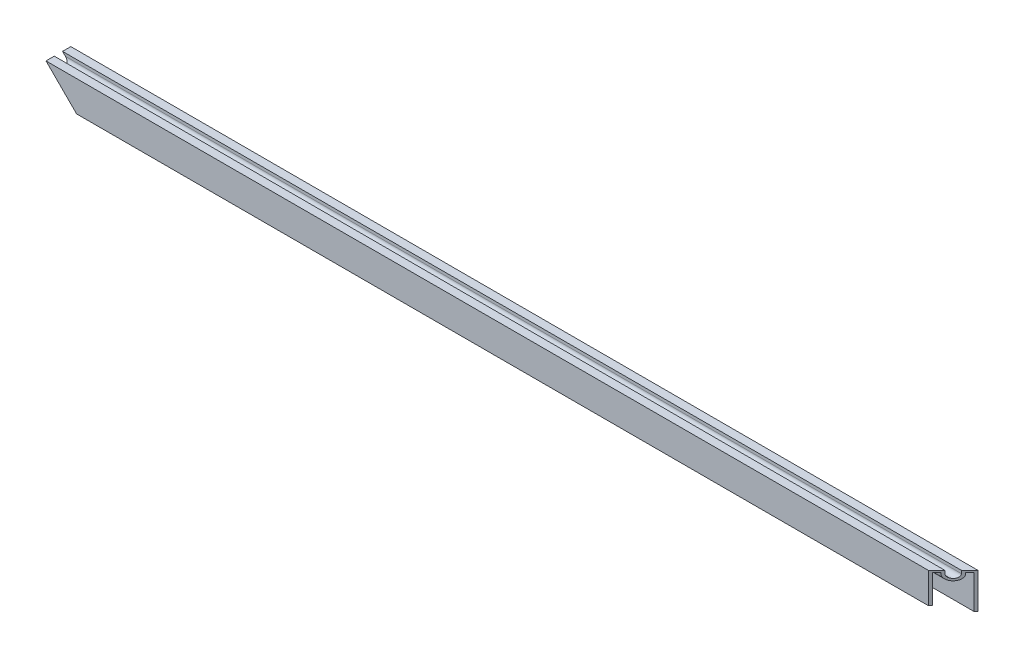
ISO-10303-21;
HEADER;
FILE_DESCRIPTION(('STEP AP214'),'2;1');
FILE_NAME('part.step','',(''),(''),'','','');
FILE_SCHEMA(('AUTOMOTIVE_DESIGN { 1 0 10303 214 1 1 1 1 }'));
ENDSEC;
DATA;
#1=APPLICATION_CONTEXT('core data for automotive mechanical design processes');
#2=APPLICATION_PROTOCOL_DEFINITION('international standard','automotive_design',2000,#1);
#3=PRODUCT_CONTEXT('',#1,'mechanical');
#4=PRODUCT('Part','Part','',(#3));
#5=PRODUCT_RELATED_PRODUCT_CATEGORY('part','',(#4));
#6=PRODUCT_DEFINITION_FORMATION('','',#4);
#7=PRODUCT_DEFINITION_CONTEXT('part definition',#1,'design');
#8=PRODUCT_DEFINITION('design','',#6,#7);
#9=PRODUCT_DEFINITION_SHAPE('','',#8);
#10=(LENGTH_UNIT() NAMED_UNIT(*) SI_UNIT(.MILLI.,.METRE.));
#11=(NAMED_UNIT(*) PLANE_ANGLE_UNIT() SI_UNIT($,.RADIAN.));
#12=(NAMED_UNIT(*) SI_UNIT($,.STERADIAN.) SOLID_ANGLE_UNIT());
#13=UNCERTAINTY_MEASURE_WITH_UNIT(LENGTH_MEASURE(1.E-05),#10,'distance_accuracy_value','');
#14=(GEOMETRIC_REPRESENTATION_CONTEXT(3) GLOBAL_UNCERTAINTY_ASSIGNED_CONTEXT((#13)) GLOBAL_UNIT_ASSIGNED_CONTEXT((#10,
#11,#12)) REPRESENTATION_CONTEXT('',''));
#15=CARTESIAN_POINT('',(0.,0.,0.));
#16=DIRECTION('',(0.,0.,1.));
#17=DIRECTION('',(1.,0.,0.));
#18=AXIS2_PLACEMENT_3D('',#15,#16,#17);
#19=CARTESIAN_POINT('',(278.60625,0.,0.));
#20=DIRECTION('',(0.,1.,0.));
#21=DIRECTION('',(0.,0.,1.));
#22=AXIS2_PLACEMENT_3D('',#19,#20,#21);
#23=PLANE('',#22);
#24=DIRECTION('',(-1.,0.,0.));
#25=VECTOR('',#24,1.);
#26=CARTESIAN_POINT('',(278.60625,0.,0.));
#27=LINE('',#26,#25);
#28=CARTESIAN_POINT('',(278.60625,0.,0.));
#29=VERTEX_POINT('',#28);
#30=CARTESIAN_POINT('',(-256.76225,0.,0.));
#31=VERTEX_POINT('',#30);
#32=EDGE_CURVE('E11',#29,#31,#27,.T.);
#33=ORIENTED_EDGE('',*,*,#32,.F.);
#34=DIRECTION('',(-0.707106781186547,0.,0.707106781186548));
#35=VECTOR('',#34,1.);
#36=CARTESIAN_POINT('',(278.60625,0.,0.));
#37=LINE('',#36,#35);
#38=CARTESIAN_POINT('',(277.33625,0.,1.27));
#39=VERTEX_POINT('',#38);
#40=EDGE_CURVE('E59',#29,#39,#37,.T.);
#41=ORIENTED_EDGE('',*,*,#40,.T.);
#42=DIRECTION('',(-1.,0.,0.));
#43=VECTOR('',#42,1.);
#44=CARTESIAN_POINT('',(278.60625,0.,1.27));
#45=LINE('',#44,#43);
#46=CARTESIAN_POINT('',(-256.76225,0.,1.27));
#47=VERTEX_POINT('',#46);
#48=EDGE_CURVE('E158',#39,#47,#45,.T.);
#49=ORIENTED_EDGE('',*,*,#48,.T.);
#50=DIRECTION('',(0.,0.,1.));
#51=VECTOR('',#50,1.);
#52=CARTESIAN_POINT('',(-256.76225,0.,0.));
#53=LINE('',#52,#51);
#54=EDGE_CURVE('E236',#31,#47,#53,.T.);
#55=ORIENTED_EDGE('',*,*,#54,.F.);
#56=EDGE_LOOP('',(#33,#41,#49,#55));
#57=FACE_BOUND('',#56,.T.);
#58=ADVANCED_FACE('F45',(#57),#23,.F.);
#59=CARTESIAN_POINT('',(278.60625,0.,0.));
#60=DIRECTION('',(0.,0.,1.));
#61=DIRECTION('',(1.,0.,0.));
#62=AXIS2_PLACEMENT_3D('',#59,#60,#61);
#63=PLANE('',#62);
#64=ORIENTED_EDGE('',*,*,#32,.T.);
#65=DIRECTION('',(-0.707106781186547,0.707106781186548,0.));
#66=VECTOR('',#65,1.);
#67=CARTESIAN_POINT('',(-278.60625,21.844,0.));
#68=LINE('',#67,#66);
#69=CARTESIAN_POINT('',(-278.60625,21.844,0.));
#70=VERTEX_POINT('',#69);
#71=EDGE_CURVE('E171',#31,#70,#68,.T.);
#72=ORIENTED_EDGE('',*,*,#71,.T.);
#73=DIRECTION('',(-1.,0.,0.));
#74=VECTOR('',#73,1.);
#75=CARTESIAN_POINT('',(278.60625,21.844,0.));
#76=LINE('',#75,#74);
#77=CARTESIAN_POINT('',(278.60625,21.844,0.));
#78=VERTEX_POINT('',#77);
#79=EDGE_CURVE('E53',#78,#70,#76,.T.);
#80=ORIENTED_EDGE('',*,*,#79,.F.);
#81=DIRECTION('',(0.,1.,0.));
#82=VECTOR('',#81,1.);
#83=CARTESIAN_POINT('',(278.60625,0.,0.));
#84=LINE('',#83,#82);
#85=EDGE_CURVE('E150',#29,#78,#84,.T.);
#86=ORIENTED_EDGE('',*,*,#85,.F.);
#87=EDGE_LOOP('',(#64,#72,#80,#86));
#88=FACE_BOUND('',#87,.T.);
#89=ADVANCED_FACE('F170',(#88),#63,.F.);
#90=CARTESIAN_POINT('',(278.60625,21.844,0.));
#91=DIRECTION('',(0.,-1.,0.));
#92=DIRECTION('',(0.,0.,-1.));
#93=AXIS2_PLACEMENT_3D('',#90,#91,#92);
#94=PLANE('',#93);
#95=DIRECTION('',(-1.,0.,0.));
#96=VECTOR('',#95,1.);
#97=CARTESIAN_POINT('',(278.60625,21.844,5.08));
#98=LINE('',#97,#96);
#99=CARTESIAN_POINT('',(273.52625,21.844,5.08));
#100=VERTEX_POINT('',#99);
#101=CARTESIAN_POINT('',(-278.60625,21.844,5.08));
#102=VERTEX_POINT('',#101);
#103=EDGE_CURVE('E166',#100,#102,#98,.T.);
#104=ORIENTED_EDGE('',*,*,#103,.F.);
#105=DIRECTION('',(-0.707106781186547,0.,0.707106781186548));
#106=VECTOR('',#105,1.);
#107=CARTESIAN_POINT('',(278.60625,21.844,0.));
#108=LINE('',#107,#106);
#109=EDGE_CURVE('E153',#78,#100,#108,.T.);
#110=ORIENTED_EDGE('',*,*,#109,.F.);
#111=ORIENTED_EDGE('',*,*,#79,.T.);
#112=DIRECTION('',(0.,0.,1.));
#113=VECTOR('',#112,1.);
#114=CARTESIAN_POINT('',(-278.60625,21.844,0.));
#115=LINE('',#114,#113);
#116=EDGE_CURVE('E201',#70,#102,#115,.T.);
#117=ORIENTED_EDGE('',*,*,#116,.T.);
#118=EDGE_LOOP('',(#104,#110,#111,#117));
#119=FACE_BOUND('',#118,.T.);
#120=ADVANCED_FACE('F164',(#119),#94,.F.);
#121=CARTESIAN_POINT('',(278.60625,21.844,5.08));
#122=DIRECTION('',(0.,0.,-1.));
#123=DIRECTION('',(-1.,0.,0.));
#124=AXIS2_PLACEMENT_3D('',#121,#122,#123);
#125=PLANE('',#124);
#126=DIRECTION('',(-1.,0.,0.));
#127=VECTOR('',#126,1.);
#128=CARTESIAN_POINT('',(278.60625,20.066,5.08));
#129=LINE('',#128,#127);
#130=CARTESIAN_POINT('',(273.52625,20.066,5.08));
#131=VERTEX_POINT('',#130);
#132=CARTESIAN_POINT('',(-276.82825,20.066,5.08));
#133=VERTEX_POINT('',#132);
#134=EDGE_CURVE('E172',#131,#133,#129,.T.);
#135=ORIENTED_EDGE('',*,*,#134,.F.);
#136=DIRECTION('',(0.,1.,0.));
#137=VECTOR('',#136,1.);
#138=CARTESIAN_POINT('',(273.52625,21.844,5.08));
#139=LINE('',#138,#137);
#140=EDGE_CURVE('E242',#131,#100,#139,.T.);
#141=ORIENTED_EDGE('',*,*,#140,.T.);
#142=ORIENTED_EDGE('',*,*,#103,.T.);
#143=DIRECTION('',(0.707106781186547,-0.707106781186548,0.));
#144=VECTOR('',#143,1.);
#145=CARTESIAN_POINT('',(-3.88578058618805E-13,-256.76225,5.08));
#146=LINE('',#145,#144);
#147=EDGE_CURVE('E202',#102,#133,#146,.T.);
#148=ORIENTED_EDGE('',*,*,#147,.T.);
#149=EDGE_LOOP('',(#135,#141,#142,#148));
#150=FACE_BOUND('',#149,.T.);
#151=ADVANCED_FACE('F334',(#150),#125,.F.);
#152=CARTESIAN_POINT('',(278.60625,20.066,7.62));
#153=DIRECTION('',(-1.,0.,0.));
#154=DIRECTION('',(0.,0.,1.));
#155=AXIS2_PLACEMENT_3D('',#152,#153,#154);
#156=CYLINDRICAL_SURFACE('',#155,2.54);
#157=DIRECTION('',(-1.,0.,0.));
#158=VECTOR('',#157,1.);
#159=CARTESIAN_POINT('',(278.60625,20.066,10.16));
#160=LINE('',#159,#158);
#161=CARTESIAN_POINT('',(268.44625,20.066,10.16));
#162=VERTEX_POINT('',#161);
#163=CARTESIAN_POINT('',(-276.82825,20.066,10.16));
#164=VERTEX_POINT('',#163);
#165=EDGE_CURVE('E176',#162,#164,#160,.T.);
#166=ORIENTED_EDGE('',*,*,#165,.F.);
#167=CARTESIAN_POINT('',(270.98625,20.066,7.62));
#168=DIRECTION('',(-0.707106781186548,0.,-0.707106781186547));
#169=DIRECTION('',(-0.707106781186547,0.,0.707106781186548));
#170=AXIS2_PLACEMENT_3D('',#167,#168,#169);
#171=ELLIPSE('',#170,3.59210244842766,2.54);
#172=EDGE_CURVE('E245',#162,#131,#171,.F.);
#173=ORIENTED_EDGE('',*,*,#172,.T.);
#174=ORIENTED_EDGE('',*,*,#134,.T.);
#175=CARTESIAN_POINT('',(-276.82825,20.066,7.62));
#176=DIRECTION('',(0.707106781186548,0.707106781186547,0.));
#177=DIRECTION('',(-0.707106781186547,0.707106781186548,0.));
#178=AXIS2_PLACEMENT_3D('',#175,#176,#177);
#179=ELLIPSE('',#178,3.59210244842766,2.54);
#180=EDGE_CURVE('E206',#133,#164,#179,.F.);
#181=ORIENTED_EDGE('',*,*,#180,.T.);
#182=EDGE_LOOP('',(#166,#173,#174,#181));
#183=FACE_BOUND('',#182,.T.);
#184=ADVANCED_FACE('F331',(#183),#156,.F.);
#185=CARTESIAN_POINT('',(278.60625,20.066,10.16));
#186=DIRECTION('',(0.,0.,1.));
#187=DIRECTION('',(0.,-1.,0.));
#188=AXIS2_PLACEMENT_3D('',#185,#186,#187);
#189=PLANE('',#188);
#190=DIRECTION('',(-1.,0.,0.));
#191=VECTOR('',#190,1.);
#192=CARTESIAN_POINT('',(278.60625,21.844,10.16));
#193=LINE('',#192,#191);
#194=CARTESIAN_POINT('',(268.44625,21.844,10.16));
#195=VERTEX_POINT('',#194);
#196=CARTESIAN_POINT('',(-278.60625,21.844,10.16));
#197=VERTEX_POINT('',#196);
#198=EDGE_CURVE('E178',#195,#197,#193,.T.);
#199=ORIENTED_EDGE('',*,*,#198,.F.);
#200=DIRECTION('',(0.,-1.,0.));
#201=VECTOR('',#200,1.);
#202=CARTESIAN_POINT('',(268.44625,20.066,10.16));
#203=LINE('',#202,#201);
#204=EDGE_CURVE('E248',#195,#162,#203,.T.);
#205=ORIENTED_EDGE('',*,*,#204,.T.);
#206=ORIENTED_EDGE('',*,*,#165,.T.);
#207=DIRECTION('',(-0.707106781186547,0.707106781186548,0.));
#208=VECTOR('',#207,1.);
#209=CARTESIAN_POINT('',(0.88899999999964,-257.65125,10.1600000000003));
#210=LINE('',#209,#208);
#211=EDGE_CURVE('E209',#164,#197,#210,.T.);
#212=ORIENTED_EDGE('',*,*,#211,.T.);
#213=EDGE_LOOP('',(#199,#205,#206,#212));
#214=FACE_BOUND('',#213,.T.);
#215=ADVANCED_FACE('F326',(#214),#189,.F.);
#216=CARTESIAN_POINT('',(278.60625,21.844,10.16));
#217=DIRECTION('',(0.,-1.,0.));
#218=DIRECTION('',(0.,0.,-1.));
#219=AXIS2_PLACEMENT_3D('',#216,#217,#218);
#220=PLANE('',#219);
#221=DIRECTION('',(-1.,0.,0.));
#222=VECTOR('',#221,1.);
#223=CARTESIAN_POINT('',(278.60625,21.844,15.24));
#224=LINE('',#223,#222);
#225=CARTESIAN_POINT('',(263.36625,21.844,15.24));
#226=VERTEX_POINT('',#225);
#227=CARTESIAN_POINT('',(-278.60625,21.844,15.24));
#228=VERTEX_POINT('',#227);
#229=EDGE_CURVE('E180',#226,#228,#224,.T.);
#230=ORIENTED_EDGE('',*,*,#229,.F.);
#231=EDGE_CURVE('E167',#195,#226,#108,.T.);
#232=ORIENTED_EDGE('',*,*,#231,.F.);
#233=ORIENTED_EDGE('',*,*,#198,.T.);
#234=DIRECTION('',(0.,0.,1.));
#235=VECTOR('',#234,1.);
#236=CARTESIAN_POINT('',(-278.60625,21.844,10.16));
#237=LINE('',#236,#235);
#238=EDGE_CURVE('E159',#197,#228,#237,.T.);
#239=ORIENTED_EDGE('',*,*,#238,.T.);
#240=EDGE_LOOP('',(#230,#232,#233,#239));
#241=FACE_BOUND('',#240,.T.);
#242=ADVANCED_FACE('F322',(#241),#220,.F.);
#243=CARTESIAN_POINT('',(278.60625,21.844,15.24));
#244=DIRECTION('',(0.,0.,-1.));
#245=DIRECTION('',(0.,1.,0.));
#246=AXIS2_PLACEMENT_3D('',#243,#244,#245);
#247=PLANE('',#246);
#248=DIRECTION('',(-1.,0.,0.));
#249=VECTOR('',#248,1.);
#250=CARTESIAN_POINT('',(278.60625,3.048,15.24));
#251=LINE('',#250,#249);
#252=CARTESIAN_POINT('',(263.36625,3.048,15.24));
#253=VERTEX_POINT('',#252);
#254=CARTESIAN_POINT('',(-259.81025,3.048,15.24));
#255=VERTEX_POINT('',#254);
#256=EDGE_CURVE('E182',#253,#255,#251,.T.);
#257=ORIENTED_EDGE('',*,*,#256,.F.);
#258=DIRECTION('',(0.,1.,0.));
#259=VECTOR('',#258,1.);
#260=CARTESIAN_POINT('',(263.36625,0.,15.24));
#261=LINE('',#260,#259);
#262=EDGE_CURVE('E275',#253,#226,#261,.T.);
#263=ORIENTED_EDGE('',*,*,#262,.T.);
#264=ORIENTED_EDGE('',*,*,#229,.T.);
#265=DIRECTION('',(-0.707106781186547,0.707106781186548,0.));
#266=VECTOR('',#265,1.);
#267=CARTESIAN_POINT('',(-278.60625,21.844,15.24));
#268=LINE('',#267,#266);
#269=EDGE_CURVE('E239',#255,#228,#268,.T.);
#270=ORIENTED_EDGE('',*,*,#269,.F.);
#271=EDGE_LOOP('',(#257,#263,#264,#270));
#272=FACE_BOUND('',#271,.T.);
#273=ADVANCED_FACE('F317',(#272),#247,.F.);
#274=CARTESIAN_POINT('',(278.60625,3.048,15.24));
#275=DIRECTION('',(0.,1.,0.));
#276=DIRECTION('',(0.,0.,1.));
#277=AXIS2_PLACEMENT_3D('',#274,#275,#276);
#278=PLANE('',#277);
#279=DIRECTION('',(-1.,0.,0.));
#280=VECTOR('',#279,1.);
#281=CARTESIAN_POINT('',(278.60625,3.048,13.97));
#282=LINE('',#281,#280);
#283=CARTESIAN_POINT('',(264.63625,3.048,13.97));
#284=VERTEX_POINT('',#283);
#285=CARTESIAN_POINT('',(-259.81025,3.04800000000005,13.97));
#286=VERTEX_POINT('',#285);
#287=EDGE_CURVE('E184',#284,#286,#282,.T.);
#288=ORIENTED_EDGE('',*,*,#287,.F.);
#289=DIRECTION('',(-0.707106781186547,0.,0.707106781186548));
#290=VECTOR('',#289,1.);
#291=CARTESIAN_POINT('',(270.98625,3.048,7.62));
#292=LINE('',#291,#290);
#293=EDGE_CURVE('E251',#284,#253,#292,.T.);
#294=ORIENTED_EDGE('',*,*,#293,.T.);
#295=ORIENTED_EDGE('',*,*,#256,.T.);
#296=DIRECTION('',(0.,0.,-1.));
#297=VECTOR('',#296,1.);
#298=CARTESIAN_POINT('',(-259.81025,3.048,15.24));
#299=LINE('',#298,#297);
#300=EDGE_CURVE('E212',#255,#286,#299,.T.);
#301=ORIENTED_EDGE('',*,*,#300,.T.);
#302=EDGE_LOOP('',(#288,#294,#295,#301));
#303=FACE_BOUND('',#302,.T.);
#304=ADVANCED_FACE('F314',(#303),#278,.F.);
#305=CARTESIAN_POINT('',(278.60625,20.574,13.97));
#306=DIRECTION('',(0.,0.,1.));
#307=DIRECTION('',(1.,0.,0.));
#308=AXIS2_PLACEMENT_3D('',#305,#306,#307);
#309=PLANE('',#308);
#310=DIRECTION('',(-1.,0.,0.));
#311=VECTOR('',#310,1.);
#312=CARTESIAN_POINT('',(278.60625,20.574,13.97));
#313=LINE('',#312,#311);
#314=CARTESIAN_POINT('',(264.63625,20.574,13.97));
#315=VERTEX_POINT('',#314);
#316=CARTESIAN_POINT('',(-277.33625,20.574,13.97));
#317=VERTEX_POINT('',#316);
#318=EDGE_CURVE('E186',#315,#317,#313,.T.);
#319=ORIENTED_EDGE('',*,*,#318,.F.);
#320=DIRECTION('',(0.,-1.,0.));
#321=VECTOR('',#320,1.);
#322=CARTESIAN_POINT('',(264.63625,20.574,13.97));
#323=LINE('',#322,#321);
#324=EDGE_CURVE('E254',#315,#284,#323,.T.);
#325=ORIENTED_EDGE('',*,*,#324,.T.);
#326=ORIENTED_EDGE('',*,*,#287,.T.);
#327=DIRECTION('',(-0.707106781186547,0.707106781186548,0.));
#328=VECTOR('',#327,1.);
#329=CARTESIAN_POINT('',(0.634999999999608,-257.39725,13.97));
#330=LINE('',#329,#328);
#331=EDGE_CURVE('E215',#286,#317,#330,.T.);
#332=ORIENTED_EDGE('',*,*,#331,.T.);
#333=EDGE_LOOP('',(#319,#325,#326,#332));
#334=FACE_BOUND('',#333,.T.);
#335=ADVANCED_FACE('F309',(#334),#309,.F.);
#336=CARTESIAN_POINT('',(278.60625,20.574,11.43));
#337=DIRECTION('',(0.,1.,0.));
#338=DIRECTION('',(0.,0.,1.));
#339=AXIS2_PLACEMENT_3D('',#336,#337,#338);
#340=PLANE('',#339);
#341=DIRECTION('',(-1.,0.,0.));
#342=VECTOR('',#341,1.);
#343=CARTESIAN_POINT('',(278.60625,20.574,11.43));
#344=LINE('',#343,#342);
#345=CARTESIAN_POINT('',(267.17625,20.574,11.43));
#346=VERTEX_POINT('',#345);
#347=CARTESIAN_POINT('',(-277.33625,20.574,11.43));
#348=VERTEX_POINT('',#347);
#349=EDGE_CURVE('E188',#346,#348,#344,.T.);
#350=ORIENTED_EDGE('',*,*,#349,.F.);
#351=DIRECTION('',(-0.707106781186547,0.,0.707106781186548));
#352=VECTOR('',#351,1.);
#353=CARTESIAN_POINT('',(272.89125,20.574,5.71500000000001));
#354=LINE('',#353,#352);
#355=EDGE_CURVE('E257',#346,#315,#354,.T.);
#356=ORIENTED_EDGE('',*,*,#355,.T.);
#357=ORIENTED_EDGE('',*,*,#318,.T.);
#358=DIRECTION('',(0.,0.,-1.));
#359=VECTOR('',#358,1.);
#360=CARTESIAN_POINT('',(-277.33625,20.574,11.43));
#361=LINE('',#360,#359);
#362=EDGE_CURVE('E218',#317,#348,#361,.T.);
#363=ORIENTED_EDGE('',*,*,#362,.T.);
#364=EDGE_LOOP('',(#350,#356,#357,#363));
#365=FACE_BOUND('',#364,.T.);
#366=ADVANCED_FACE('F306',(#365),#340,.F.);
#367=CARTESIAN_POINT('',(278.60625,20.066,11.43));
#368=DIRECTION('',(0.,0.,-1.));
#369=DIRECTION('',(-1.,0.,0.));
#370=AXIS2_PLACEMENT_3D('',#367,#368,#369);
#371=PLANE('',#370);
#372=DIRECTION('',(-1.,0.,0.));
#373=VECTOR('',#372,1.);
#374=CARTESIAN_POINT('',(278.60625,20.066,11.43));
#375=LINE('',#374,#373);
#376=CARTESIAN_POINT('',(267.17625,20.066,11.43));
#377=VERTEX_POINT('',#376);
#378=CARTESIAN_POINT('',(-276.82825,20.066,11.43));
#379=VERTEX_POINT('',#378);
#380=EDGE_CURVE('E190',#377,#379,#375,.T.);
#381=ORIENTED_EDGE('',*,*,#380,.F.);
#382=DIRECTION('',(0.,1.,0.));
#383=VECTOR('',#382,1.);
#384=CARTESIAN_POINT('',(267.17625,20.066,11.43));
#385=LINE('',#384,#383);
#386=EDGE_CURVE('E260',#377,#346,#385,.T.);
#387=ORIENTED_EDGE('',*,*,#386,.T.);
#388=ORIENTED_EDGE('',*,*,#349,.T.);
#389=DIRECTION('',(0.707106781186547,-0.707106781186548,0.));
#390=VECTOR('',#389,1.);
#391=CARTESIAN_POINT('',(0.88899999999964,-257.65125,11.43));
#392=LINE('',#391,#390);
#393=EDGE_CURVE('E221',#348,#379,#392,.T.);
#394=ORIENTED_EDGE('',*,*,#393,.T.);
#395=EDGE_LOOP('',(#381,#387,#388,#394));
#396=FACE_BOUND('',#395,.T.);
#397=ADVANCED_FACE('F301',(#396),#371,.F.);
#398=CARTESIAN_POINT('',(278.60625,20.066,7.62));
#399=DIRECTION('',(-1.,0.,0.));
#400=DIRECTION('',(0.,0.,1.));
#401=AXIS2_PLACEMENT_3D('',#398,#399,#400);
#402=CYLINDRICAL_SURFACE('',#401,3.81);
#403=DIRECTION('',(-1.,0.,0.));
#404=VECTOR('',#403,1.);
#405=CARTESIAN_POINT('',(278.60625,20.066,3.81));
#406=LINE('',#405,#404);
#407=CARTESIAN_POINT('',(274.79625,20.066,3.81));
#408=VERTEX_POINT('',#407);
#409=CARTESIAN_POINT('',(-276.82825,20.066,3.81));
#410=VERTEX_POINT('',#409);
#411=EDGE_CURVE('E192',#408,#410,#406,.T.);
#412=ORIENTED_EDGE('',*,*,#411,.F.);
#413=CARTESIAN_POINT('',(270.98625,20.066,7.62));
#414=DIRECTION('',(-0.707106781186548,0.,-0.707106781186547));
#415=DIRECTION('',(-0.707106781186547,0.,0.707106781186548));
#416=AXIS2_PLACEMENT_3D('',#413,#414,#415);
#417=ELLIPSE('',#416,5.38815367264149,3.81);
#418=EDGE_CURVE('E263',#408,#377,#417,.T.);
#419=ORIENTED_EDGE('',*,*,#418,.T.);
#420=ORIENTED_EDGE('',*,*,#380,.T.);
#421=CARTESIAN_POINT('',(-276.82825,20.066,7.62));
#422=DIRECTION('',(0.707106781186548,0.707106781186547,0.));
#423=DIRECTION('',(-0.707106781186547,0.707106781186548,0.));
#424=AXIS2_PLACEMENT_3D('',#421,#422,#423);
#425=ELLIPSE('',#424,5.38815367264149,3.81);
#426=EDGE_CURVE('E224',#379,#410,#425,.T.);
#427=ORIENTED_EDGE('',*,*,#426,.T.);
#428=EDGE_LOOP('',(#412,#419,#420,#427));
#429=FACE_BOUND('',#428,.T.);
#430=ADVANCED_FACE('F298',(#429),#402,.T.);
#431=CARTESIAN_POINT('',(278.60625,20.574,3.81));
#432=DIRECTION('',(0.,0.,1.));
#433=DIRECTION('',(1.,0.,0.));
#434=AXIS2_PLACEMENT_3D('',#431,#432,#433);
#435=PLANE('',#434);
#436=DIRECTION('',(-1.,0.,0.));
#437=VECTOR('',#436,1.);
#438=CARTESIAN_POINT('',(278.60625,20.574,3.81));
#439=LINE('',#438,#437);
#440=CARTESIAN_POINT('',(274.79625,20.574,3.81));
#441=VERTEX_POINT('',#440);
#442=CARTESIAN_POINT('',(-277.33625,20.574,3.81));
#443=VERTEX_POINT('',#442);
#444=EDGE_CURVE('E194',#441,#443,#439,.T.);
#445=ORIENTED_EDGE('',*,*,#444,.F.);
#446=DIRECTION('',(0.,-1.,0.));
#447=VECTOR('',#446,1.);
#448=CARTESIAN_POINT('',(274.79625,20.574,3.81));
#449=LINE('',#448,#447);
#450=EDGE_CURVE('E266',#441,#408,#449,.T.);
#451=ORIENTED_EDGE('',*,*,#450,.T.);
#452=ORIENTED_EDGE('',*,*,#411,.T.);
#453=DIRECTION('',(-0.707106781186547,0.707106781186548,0.));
#454=VECTOR('',#453,1.);
#455=CARTESIAN_POINT('',(0.634999999999608,-257.39725,3.81));
#456=LINE('',#455,#454);
#457=EDGE_CURVE('E227',#410,#443,#456,.T.);
#458=ORIENTED_EDGE('',*,*,#457,.T.);
#459=EDGE_LOOP('',(#445,#451,#452,#458));
#460=FACE_BOUND('',#459,.T.);
#461=ADVANCED_FACE('F293',(#460),#435,.F.);
#462=CARTESIAN_POINT('',(278.60625,20.574,1.27));
#463=DIRECTION('',(0.,1.,0.));
#464=DIRECTION('',(0.,0.,1.));
#465=AXIS2_PLACEMENT_3D('',#462,#463,#464);
#466=PLANE('',#465);
#467=DIRECTION('',(-1.,0.,0.));
#468=VECTOR('',#467,1.);
#469=CARTESIAN_POINT('',(278.60625,20.574,1.27));
#470=LINE('',#469,#468);
#471=CARTESIAN_POINT('',(277.33625,20.574,1.27));
#472=VERTEX_POINT('',#471);
#473=CARTESIAN_POINT('',(-277.33625,20.574,1.27));
#474=VERTEX_POINT('',#473);
#475=EDGE_CURVE('E196',#472,#474,#470,.T.);
#476=ORIENTED_EDGE('',*,*,#475,.F.);
#477=DIRECTION('',(-0.707106781186547,0.,0.707106781186548));
#478=VECTOR('',#477,1.);
#479=CARTESIAN_POINT('',(277.97125,20.574,0.635));
#480=LINE('',#479,#478);
#481=EDGE_CURVE('E269',#472,#441,#480,.T.);
#482=ORIENTED_EDGE('',*,*,#481,.T.);
#483=ORIENTED_EDGE('',*,*,#444,.T.);
#484=DIRECTION('',(0.,0.,-1.));
#485=VECTOR('',#484,1.);
#486=CARTESIAN_POINT('',(-277.33625,20.574,1.27));
#487=LINE('',#486,#485);
#488=EDGE_CURVE('E230',#443,#474,#487,.T.);
#489=ORIENTED_EDGE('',*,*,#488,.T.);
#490=EDGE_LOOP('',(#476,#482,#483,#489));
#491=FACE_BOUND('',#490,.T.);
#492=ADVANCED_FACE('F290',(#491),#466,.F.);
#493=CARTESIAN_POINT('',(278.60625,0.,1.27));
#494=DIRECTION('',(0.,0.,-1.));
#495=DIRECTION('',(-1.,0.,0.));
#496=AXIS2_PLACEMENT_3D('',#493,#494,#495);
#497=PLANE('',#496);
#498=ORIENTED_EDGE('',*,*,#48,.F.);
#499=DIRECTION('',(0.,1.,0.));
#500=VECTOR('',#499,1.);
#501=CARTESIAN_POINT('',(277.33625,0.,1.27));
#502=LINE('',#501,#500);
#503=EDGE_CURVE('E272',#39,#472,#502,.T.);
#504=ORIENTED_EDGE('',*,*,#503,.T.);
#505=ORIENTED_EDGE('',*,*,#475,.T.);
#506=DIRECTION('',(0.707106781186547,-0.707106781186548,0.));
#507=VECTOR('',#506,1.);
#508=CARTESIAN_POINT('',(10.9219999999996,-267.68425,1.27));
#509=LINE('',#508,#507);
#510=EDGE_CURVE('E233',#474,#47,#509,.T.);
#511=ORIENTED_EDGE('',*,*,#510,.T.);
#512=EDGE_LOOP('',(#498,#504,#505,#511));
#513=FACE_BOUND('',#512,.T.);
#514=ADVANCED_FACE('F282',(#513),#497,.F.);
#515=CARTESIAN_POINT('',(-278.60625,21.844,0.));
#516=DIRECTION('',(0.707106781186548,0.707106781186547,0.));
#517=DIRECTION('',(-0.707106781186547,0.707106781186548,0.));
#518=AXIS2_PLACEMENT_3D('',#515,#516,#517);
#519=PLANE('',#518);
#520=ORIENTED_EDGE('',*,*,#116,.F.);
#521=ORIENTED_EDGE('',*,*,#71,.F.);
#522=ORIENTED_EDGE('',*,*,#54,.T.);
#523=ORIENTED_EDGE('',*,*,#510,.F.);
#524=ORIENTED_EDGE('',*,*,#488,.F.);
#525=ORIENTED_EDGE('',*,*,#457,.F.);
#526=ORIENTED_EDGE('',*,*,#426,.F.);
#527=ORIENTED_EDGE('',*,*,#393,.F.);
#528=ORIENTED_EDGE('',*,*,#362,.F.);
#529=ORIENTED_EDGE('',*,*,#331,.F.);
#530=ORIENTED_EDGE('',*,*,#300,.F.);
#531=ORIENTED_EDGE('',*,*,#269,.T.);
#532=ORIENTED_EDGE('',*,*,#238,.F.);
#533=ORIENTED_EDGE('',*,*,#211,.F.);
#534=ORIENTED_EDGE('',*,*,#180,.F.);
#535=ORIENTED_EDGE('',*,*,#147,.F.);
#536=EDGE_LOOP('',(#520,#521,#522,#523,#524,#525,#526,#527,#528,#529,#530,#531,#532,#533,#534,#535));
#537=FACE_BOUND('',#536,.T.);
#538=ADVANCED_FACE('F287',(#537),#519,.F.);
#539=CARTESIAN_POINT('',(278.60625,0.,0.));
#540=DIRECTION('',(-0.707106781186548,0.,-0.707106781186547));
#541=DIRECTION('',(-0.707106781186547,0.,0.707106781186548));
#542=AXIS2_PLACEMENT_3D('',#539,#540,#541);
#543=PLANE('',#542);
#544=ORIENTED_EDGE('',*,*,#172,.F.);
#545=ORIENTED_EDGE('',*,*,#204,.F.);
#546=ORIENTED_EDGE('',*,*,#231,.T.);
#547=ORIENTED_EDGE('',*,*,#262,.F.);
#548=ORIENTED_EDGE('',*,*,#293,.F.);
#549=ORIENTED_EDGE('',*,*,#324,.F.);
#550=ORIENTED_EDGE('',*,*,#355,.F.);
#551=ORIENTED_EDGE('',*,*,#386,.F.);
#552=ORIENTED_EDGE('',*,*,#418,.F.);
#553=ORIENTED_EDGE('',*,*,#450,.F.);
#554=ORIENTED_EDGE('',*,*,#481,.F.);
#555=ORIENTED_EDGE('',*,*,#503,.F.);
#556=ORIENTED_EDGE('',*,*,#40,.F.);
#557=ORIENTED_EDGE('',*,*,#85,.T.);
#558=ORIENTED_EDGE('',*,*,#109,.T.);
#559=ORIENTED_EDGE('',*,*,#140,.F.);
#560=EDGE_LOOP('',(#544,#545,#546,#547,#548,#549,#550,#551,#552,#553,#554,#555,#556,#557,#558,#559));
#561=FACE_BOUND('',#560,.T.);
#562=ADVANCED_FACE('F152',(#561),#543,.F.);
#563=CLOSED_SHELL('',(#58,#89,#120,#151,#184,#215,#242,#273,#304,#335,#366,#397,#430,#461,#492,
#514,#538,#562));
#564=MANIFOLD_SOLID_BREP('B2',#563);
#565=ADVANCED_BREP_SHAPE_REPRESENTATION('',(#18,#564),#14);
#566=SHAPE_DEFINITION_REPRESENTATION(#9,#565);
ENDSEC;
END-ISO-10303-21;
